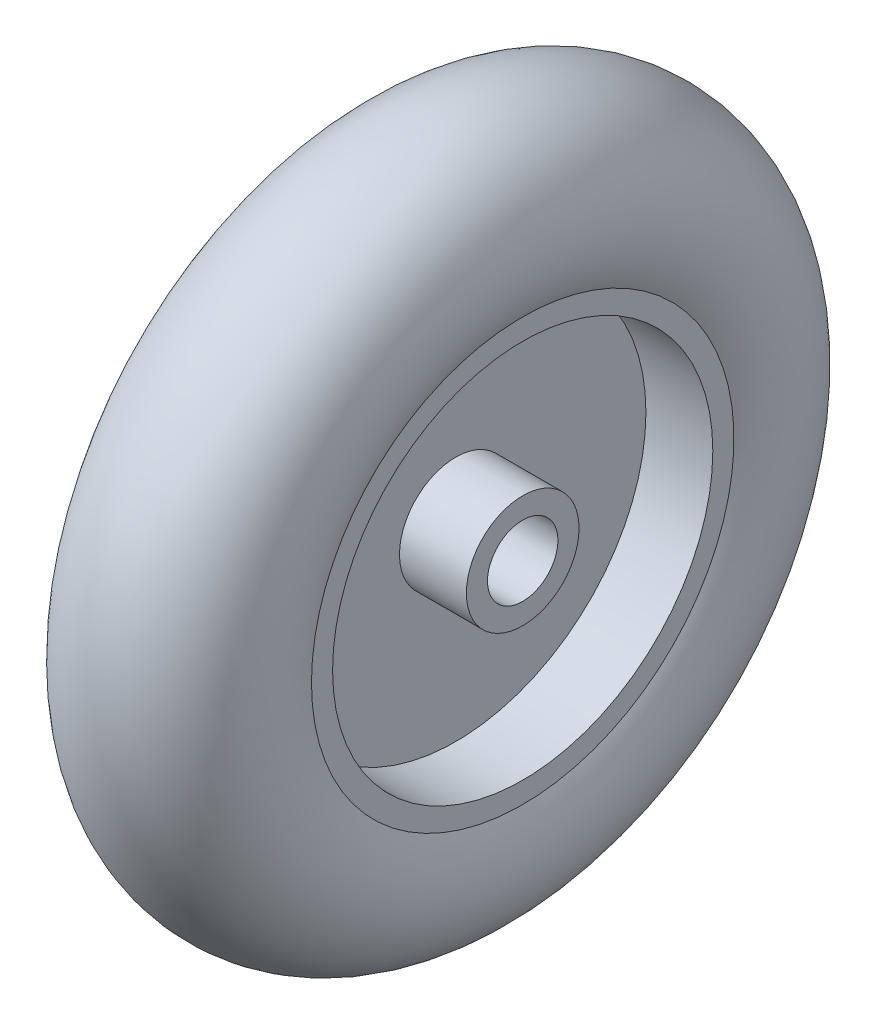
ISO-10303-21;
HEADER;
FILE_DESCRIPTION(('STEP AP214'),'2;1');
FILE_NAME('part.step','',(''),(''),'','','');
FILE_SCHEMA(('AUTOMOTIVE_DESIGN { 1 0 10303 214 1 1 1 1 }'));
ENDSEC;
DATA;
#1=APPLICATION_CONTEXT('core data for automotive mechanical design processes');
#2=APPLICATION_PROTOCOL_DEFINITION('international standard','automotive_design',2000,#1);
#3=PRODUCT_CONTEXT('',#1,'mechanical');
#4=PRODUCT('Part','Part','',(#3));
#5=PRODUCT_RELATED_PRODUCT_CATEGORY('part','',(#4));
#6=PRODUCT_DEFINITION_FORMATION('','',#4);
#7=PRODUCT_DEFINITION_CONTEXT('part definition',#1,'design');
#8=PRODUCT_DEFINITION('design','',#6,#7);
#9=PRODUCT_DEFINITION_SHAPE('','',#8);
#10=(LENGTH_UNIT() NAMED_UNIT(*) SI_UNIT(.MILLI.,.METRE.));
#11=(NAMED_UNIT(*) PLANE_ANGLE_UNIT() SI_UNIT($,.RADIAN.));
#12=(NAMED_UNIT(*) SI_UNIT($,.STERADIAN.) SOLID_ANGLE_UNIT());
#13=UNCERTAINTY_MEASURE_WITH_UNIT(LENGTH_MEASURE(1.E-05),#10,'distance_accuracy_value','');
#14=(GEOMETRIC_REPRESENTATION_CONTEXT(3) GLOBAL_UNCERTAINTY_ASSIGNED_CONTEXT((#13)) GLOBAL_UNIT_ASSIGNED_CONTEXT((#10,
#11,#12)) REPRESENTATION_CONTEXT('',''));
#15=CARTESIAN_POINT('',(0.,0.,0.));
#16=DIRECTION('',(0.,0.,1.));
#17=DIRECTION('',(1.,0.,0.));
#18=AXIS2_PLACEMENT_3D('',#15,#16,#17);
#19=CARTESIAN_POINT('',(-2.5,0.,-8.));
#20=DIRECTION('',(1.,0.,0.));
#21=DIRECTION('',(0.,0.,-1.));
#22=AXIS2_PLACEMENT_3D('',#19,#20,#21);
#23=PLANE('',#22);
#24=CARTESIAN_POINT('',(-2.5,0.,0.));
#25=DIRECTION('',(-1.,0.,0.));
#26=DIRECTION('',(0.,0.,1.));
#27=AXIS2_PLACEMENT_3D('',#24,#25,#26);
#28=CIRCLE('',#27,8.);
#29=CARTESIAN_POINT('',(-2.5,0.,8.));
#30=VERTEX_POINT('',#29);
#31=EDGE_CURVE('E10',#30,#30,#28,.T.);
#32=ORIENTED_EDGE('',*,*,#31,.F.);
#33=EDGE_LOOP('',(#32));
#34=FACE_BOUND('',#33,.T.);
#35=CARTESIAN_POINT('',(-2.5,0.,0.));
#36=DIRECTION('',(-1.,0.,0.));
#37=DIRECTION('',(0.,0.,1.));
#38=AXIS2_PLACEMENT_3D('',#35,#36,#37);
#39=CIRCLE('',#38,27.);
#40=CARTESIAN_POINT('',(-2.5,0.,27.));
#41=VERTEX_POINT('',#40);
#42=EDGE_CURVE('E90',#41,#41,#39,.T.);
#43=ORIENTED_EDGE('',*,*,#42,.T.);
#44=EDGE_LOOP('',(#43));
#45=FACE_BOUND('',#44,.T.);
#46=ADVANCED_FACE('F39',(#34,#45),#23,.F.);
#47=CARTESIAN_POINT('',(-7.02201807275476,0.,0.));
#48=DIRECTION('',(-1.,0.,0.));
#49=DIRECTION('',(0.,0.,1.));
#50=AXIS2_PLACEMENT_3D('',#47,#48,#49);
#51=CYLINDRICAL_SURFACE('',#50,8.);
#52=CARTESIAN_POINT('',(-12.,0.,0.));
#53=DIRECTION('',(-1.,0.,0.));
#54=DIRECTION('',(0.,0.,1.));
#55=AXIS2_PLACEMENT_3D('',#52,#53,#54);
#56=CIRCLE('',#55,8.);
#57=CARTESIAN_POINT('',(-12.,0.,8.));
#58=VERTEX_POINT('',#57);
#59=EDGE_CURVE('E46',#58,#58,#56,.T.);
#60=ORIENTED_EDGE('',*,*,#59,.F.);
#61=EDGE_LOOP('',(#60));
#62=FACE_BOUND('',#61,.T.);
#63=ORIENTED_EDGE('',*,*,#31,.T.);
#64=EDGE_LOOP('',(#63));
#65=FACE_BOUND('',#64,.T.);
#66=ADVANCED_FACE('F152',(#62,#65),#51,.T.);
#67=CARTESIAN_POINT('',(-12.,0.,-5.));
#68=DIRECTION('',(1.,0.,0.));
#69=DIRECTION('',(0.,0.,-1.));
#70=AXIS2_PLACEMENT_3D('',#67,#68,#69);
#71=PLANE('',#70);
#72=CARTESIAN_POINT('',(-12.,0.,0.));
#73=DIRECTION('',(-1.,0.,0.));
#74=DIRECTION('',(0.,0.,1.));
#75=AXIS2_PLACEMENT_3D('',#72,#73,#74);
#76=CIRCLE('',#75,5.);
#77=CARTESIAN_POINT('',(-12.,0.,5.));
#78=VERTEX_POINT('',#77);
#79=EDGE_CURVE('E51',#78,#78,#76,.T.);
#80=ORIENTED_EDGE('',*,*,#79,.F.);
#81=EDGE_LOOP('',(#80));
#82=FACE_BOUND('',#81,.T.);
#83=ORIENTED_EDGE('',*,*,#59,.T.);
#84=EDGE_LOOP('',(#83));
#85=FACE_BOUND('',#84,.T.);
#86=ADVANCED_FACE('F147',(#82,#85),#71,.F.);
#87=CARTESIAN_POINT('',(-7.02201807275476,0.,0.));
#88=DIRECTION('',(-1.,0.,0.));
#89=DIRECTION('',(0.,0.,1.));
#90=AXIS2_PLACEMENT_3D('',#87,#88,#89);
#91=CYLINDRICAL_SURFACE('',#90,5.);
#92=CARTESIAN_POINT('',(12.,0.,0.));
#93=DIRECTION('',(-1.,0.,0.));
#94=DIRECTION('',(0.,0.,1.));
#95=AXIS2_PLACEMENT_3D('',#92,#93,#94);
#96=CIRCLE('',#95,5.);
#97=CARTESIAN_POINT('',(12.,0.,5.));
#98=VERTEX_POINT('',#97);
#99=EDGE_CURVE('E56',#98,#98,#96,.T.);
#100=ORIENTED_EDGE('',*,*,#99,.F.);
#101=EDGE_LOOP('',(#100));
#102=FACE_BOUND('',#101,.T.);
#103=ORIENTED_EDGE('',*,*,#79,.T.);
#104=EDGE_LOOP('',(#103));
#105=FACE_BOUND('',#104,.T.);
#106=ADVANCED_FACE('F141',(#102,#105),#91,.F.);
#107=CARTESIAN_POINT('',(12.,0.,-5.));
#108=DIRECTION('',(-1.,0.,0.));
#109=DIRECTION('',(0.,0.,1.));
#110=AXIS2_PLACEMENT_3D('',#107,#108,#109);
#111=PLANE('',#110);
#112=CARTESIAN_POINT('',(12.,0.,0.));
#113=DIRECTION('',(-1.,0.,0.));
#114=DIRECTION('',(0.,0.,1.));
#115=AXIS2_PLACEMENT_3D('',#112,#113,#114);
#116=CIRCLE('',#115,8.);
#117=CARTESIAN_POINT('',(12.,0.,8.));
#118=VERTEX_POINT('',#117);
#119=EDGE_CURVE('E62',#118,#118,#116,.T.);
#120=ORIENTED_EDGE('',*,*,#119,.F.);
#121=EDGE_LOOP('',(#120));
#122=FACE_BOUND('',#121,.T.);
#123=ORIENTED_EDGE('',*,*,#99,.T.);
#124=EDGE_LOOP('',(#123));
#125=FACE_BOUND('',#124,.T.);
#126=ADVANCED_FACE('F135',(#122,#125),#111,.F.);
#127=CARTESIAN_POINT('',(-7.02201807275476,0.,0.));
#128=DIRECTION('',(-1.,0.,0.));
#129=DIRECTION('',(0.,0.,1.));
#130=AXIS2_PLACEMENT_3D('',#127,#128,#129);
#131=CYLINDRICAL_SURFACE('',#130,8.);
#132=CARTESIAN_POINT('',(2.5,0.,0.));
#133=DIRECTION('',(-1.,0.,0.));
#134=DIRECTION('',(0.,0.,1.));
#135=AXIS2_PLACEMENT_3D('',#132,#133,#134);
#136=CIRCLE('',#135,8.);
#137=CARTESIAN_POINT('',(2.5,0.,8.));
#138=VERTEX_POINT('',#137);
#139=EDGE_CURVE('E66',#138,#138,#136,.T.);
#140=ORIENTED_EDGE('',*,*,#139,.F.);
#141=EDGE_LOOP('',(#140));
#142=FACE_BOUND('',#141,.T.);
#143=ORIENTED_EDGE('',*,*,#119,.T.);
#144=EDGE_LOOP('',(#143));
#145=FACE_BOUND('',#144,.T.);
#146=ADVANCED_FACE('F129',(#142,#145),#131,.T.);
#147=CARTESIAN_POINT('',(2.5,0.,-27.));
#148=DIRECTION('',(-1.,0.,0.));
#149=DIRECTION('',(0.,0.,1.));
#150=AXIS2_PLACEMENT_3D('',#147,#148,#149);
#151=PLANE('',#150);
#152=CARTESIAN_POINT('',(2.5,0.,0.));
#153=DIRECTION('',(-1.,0.,0.));
#154=DIRECTION('',(0.,0.,1.));
#155=AXIS2_PLACEMENT_3D('',#152,#153,#154);
#156=CIRCLE('',#155,27.);
#157=CARTESIAN_POINT('',(2.5,0.,27.));
#158=VERTEX_POINT('',#157);
#159=EDGE_CURVE('E70',#158,#158,#156,.T.);
#160=ORIENTED_EDGE('',*,*,#159,.F.);
#161=EDGE_LOOP('',(#160));
#162=FACE_BOUND('',#161,.T.);
#163=ORIENTED_EDGE('',*,*,#139,.T.);
#164=EDGE_LOOP('',(#163));
#165=FACE_BOUND('',#164,.T.);
#166=ADVANCED_FACE('F123',(#162,#165),#151,.F.);
#167=CARTESIAN_POINT('',(-7.02201807275476,0.,0.));
#168=DIRECTION('',(-1.,0.,0.));
#169=DIRECTION('',(0.,0.,1.));
#170=AXIS2_PLACEMENT_3D('',#167,#168,#169);
#171=CYLINDRICAL_SURFACE('',#170,27.);
#172=CARTESIAN_POINT('',(12.,0.,0.));
#173=DIRECTION('',(-1.,0.,0.));
#174=DIRECTION('',(0.,0.,1.));
#175=AXIS2_PLACEMENT_3D('',#172,#173,#174);
#176=CIRCLE('',#175,27.);
#177=CARTESIAN_POINT('',(12.,0.,27.));
#178=VERTEX_POINT('',#177);
#179=EDGE_CURVE('E74',#178,#178,#176,.T.);
#180=ORIENTED_EDGE('',*,*,#179,.F.);
#181=EDGE_LOOP('',(#180));
#182=FACE_BOUND('',#181,.T.);
#183=ORIENTED_EDGE('',*,*,#159,.T.);
#184=EDGE_LOOP('',(#183));
#185=FACE_BOUND('',#184,.T.);
#186=ADVANCED_FACE('F117',(#182,#185),#171,.F.);
#187=CARTESIAN_POINT('',(12.,0.,-27.));
#188=DIRECTION('',(-1.,0.,0.));
#189=DIRECTION('',(0.,0.,1.));
#190=AXIS2_PLACEMENT_3D('',#187,#188,#189);
#191=PLANE('',#190);
#192=CARTESIAN_POINT('',(12.,0.,0.));
#193=DIRECTION('',(-1.,0.,0.));
#194=DIRECTION('',(0.,0.,1.));
#195=AXIS2_PLACEMENT_3D('',#192,#193,#194);
#196=CIRCLE('',#195,30.);
#197=CARTESIAN_POINT('',(12.,0.,30.));
#198=VERTEX_POINT('',#197);
#199=EDGE_CURVE('E78',#198,#198,#196,.T.);
#200=ORIENTED_EDGE('',*,*,#199,.F.);
#201=EDGE_LOOP('',(#200));
#202=FACE_BOUND('',#201,.T.);
#203=ORIENTED_EDGE('',*,*,#179,.T.);
#204=EDGE_LOOP('',(#203));
#205=FACE_BOUND('',#204,.T.);
#206=ADVANCED_FACE('F111',(#202,#205),#191,.F.);
#207=CARTESIAN_POINT('',(0.,0.,0.));
#208=DIRECTION('',(-1.,0.,0.));
#209=DIRECTION('',(0.,0.,1.));
#210=AXIS2_PLACEMENT_3D('',#207,#208,#209);
#211=TOROIDAL_SURFACE('',#210,36.4,13.6);
#212=CARTESIAN_POINT('',(-12.,0.,0.));
#213=DIRECTION('',(-1.,0.,0.));
#214=DIRECTION('',(0.,0.,1.));
#215=AXIS2_PLACEMENT_3D('',#212,#213,#214);
#216=CIRCLE('',#215,30.);
#217=CARTESIAN_POINT('',(-12.,0.,30.));
#218=VERTEX_POINT('',#217);
#219=EDGE_CURVE('E82',#218,#218,#216,.T.);
#220=ORIENTED_EDGE('',*,*,#219,.F.);
#221=EDGE_LOOP('',(#220));
#222=FACE_BOUND('',#221,.T.);
#223=ORIENTED_EDGE('',*,*,#199,.T.);
#224=EDGE_LOOP('',(#223));
#225=FACE_BOUND('',#224,.T.);
#226=ADVANCED_FACE('F105',(#222,#225),#211,.T.);
#227=CARTESIAN_POINT('',(-12.,0.,-27.));
#228=DIRECTION('',(1.,0.,0.));
#229=DIRECTION('',(0.,0.,-1.));
#230=AXIS2_PLACEMENT_3D('',#227,#228,#229);
#231=PLANE('',#230);
#232=CARTESIAN_POINT('',(-12.,0.,0.));
#233=DIRECTION('',(-1.,0.,0.));
#234=DIRECTION('',(0.,0.,1.));
#235=AXIS2_PLACEMENT_3D('',#232,#233,#234);
#236=CIRCLE('',#235,27.);
#237=CARTESIAN_POINT('',(-12.,0.,27.));
#238=VERTEX_POINT('',#237);
#239=EDGE_CURVE('E86',#238,#238,#236,.T.);
#240=ORIENTED_EDGE('',*,*,#239,.F.);
#241=EDGE_LOOP('',(#240));
#242=FACE_BOUND('',#241,.T.);
#243=ORIENTED_EDGE('',*,*,#219,.T.);
#244=EDGE_LOOP('',(#243));
#245=FACE_BOUND('',#244,.T.);
#246=ADVANCED_FACE('F99',(#242,#245),#231,.F.);
#247=CARTESIAN_POINT('',(-7.02201807275476,0.,0.));
#248=DIRECTION('',(-1.,0.,0.));
#249=DIRECTION('',(0.,0.,1.));
#250=AXIS2_PLACEMENT_3D('',#247,#248,#249);
#251=CYLINDRICAL_SURFACE('',#250,27.);
#252=ORIENTED_EDGE('',*,*,#42,.F.);
#253=EDGE_LOOP('',(#252));
#254=FACE_BOUND('',#253,.T.);
#255=ORIENTED_EDGE('',*,*,#239,.T.);
#256=EDGE_LOOP('',(#255));
#257=FACE_BOUND('',#256,.T.);
#258=ADVANCED_FACE('F96',(#254,#257),#251,.F.);
#259=CLOSED_SHELL('',(#46,#66,#86,#106,#126,#146,#166,#186,#206,#226,#246,#258));
#260=MANIFOLD_SOLID_BREP('B2',#259);
#261=ADVANCED_BREP_SHAPE_REPRESENTATION('',(#18,#260),#14);
#262=SHAPE_DEFINITION_REPRESENTATION(#9,#261);
ENDSEC;
END-ISO-10303-21;
